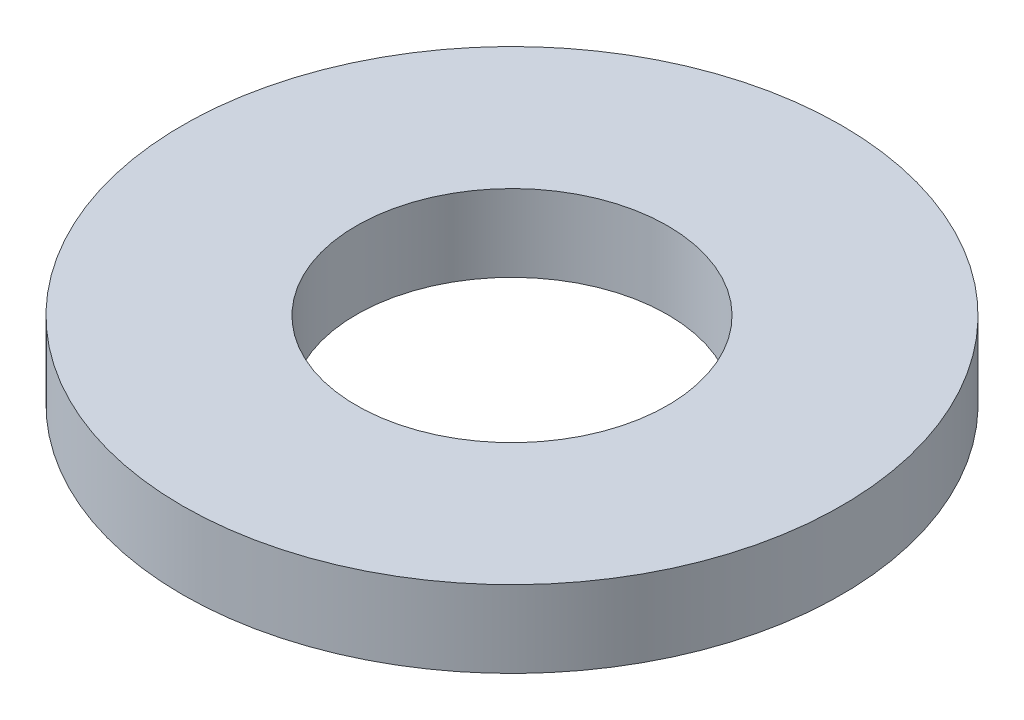
ISO-10303-21;
HEADER;
FILE_DESCRIPTION(('STEP AP214'),'2;1');
FILE_NAME('part.step','',(''),(''),'','','');
FILE_SCHEMA(('AUTOMOTIVE_DESIGN { 1 0 10303 214 1 1 1 1 }'));
ENDSEC;
DATA;
#1=APPLICATION_CONTEXT('core data for automotive mechanical design processes');
#2=APPLICATION_PROTOCOL_DEFINITION('international standard','automotive_design',2000,#1);
#3=PRODUCT_CONTEXT('',#1,'mechanical');
#4=PRODUCT('Part','Part','',(#3));
#5=PRODUCT_RELATED_PRODUCT_CATEGORY('part','',(#4));
#6=PRODUCT_DEFINITION_FORMATION('','',#4);
#7=PRODUCT_DEFINITION_CONTEXT('part definition',#1,'design');
#8=PRODUCT_DEFINITION('design','',#6,#7);
#9=PRODUCT_DEFINITION_SHAPE('','',#8);
#10=(LENGTH_UNIT() NAMED_UNIT(*) SI_UNIT(.MILLI.,.METRE.));
#11=(NAMED_UNIT(*) PLANE_ANGLE_UNIT() SI_UNIT($,.RADIAN.));
#12=(NAMED_UNIT(*) SI_UNIT($,.STERADIAN.) SOLID_ANGLE_UNIT());
#13=UNCERTAINTY_MEASURE_WITH_UNIT(LENGTH_MEASURE(1.E-05),#10,'distance_accuracy_value','');
#14=(GEOMETRIC_REPRESENTATION_CONTEXT(3) GLOBAL_UNCERTAINTY_ASSIGNED_CONTEXT((#13)) GLOBAL_UNIT_ASSIGNED_CONTEXT((#10,
#11,#12)) REPRESENTATION_CONTEXT('',''));
#15=CARTESIAN_POINT('',(0.,0.,0.));
#16=DIRECTION('',(0.,0.,1.));
#17=DIRECTION('',(1.,0.,0.));
#18=AXIS2_PLACEMENT_3D('',#15,#16,#17);
#19=CARTESIAN_POINT('',(0.,21.,0.));
#20=DIRECTION('',(0.,-1.,0.));
#21=DIRECTION('',(0.,0.,-1.));
#22=AXIS2_PLACEMENT_3D('',#19,#20,#21);
#23=CYLINDRICAL_SURFACE('',#22,90.);
#24=CARTESIAN_POINT('',(0.,21.,0.));
#25=DIRECTION('',(0.,1.,0.));
#26=DIRECTION('',(0.,0.,1.));
#27=AXIS2_PLACEMENT_3D('',#24,#25,#26);
#28=CIRCLE('',#27,90.);
#29=CARTESIAN_POINT('',(0.,21.,-90.));
#30=VERTEX_POINT('',#29);
#31=EDGE_CURVE('E10',#30,#30,#28,.T.);
#32=CARTESIAN_POINT('',(0.,0.,0.));
#33=DIRECTION('',(0.,1.,0.));
#34=DIRECTION('',(0.,0.,1.));
#35=AXIS2_PLACEMENT_3D('',#32,#33,#34);
#36=CIRCLE('',#35,90.);
#37=CARTESIAN_POINT('',(0.,0.,-90.));
#38=VERTEX_POINT('',#37);
#39=EDGE_CURVE('E37',#38,#38,#36,.T.);
#40=CARTESIAN_POINT('',(0.,21.,-90.));
#41=CARTESIAN_POINT('',(0.,20.78125,-90.));
#42=CARTESIAN_POINT('',(0.,20.5625,-90.));
#43=CARTESIAN_POINT('',(0.,20.125,-90.));
#44=CARTESIAN_POINT('',(0.,19.90625,-90.));
#45=CARTESIAN_POINT('',(0.,19.46875,-90.));
#46=CARTESIAN_POINT('',(0.,19.25,-90.));
#47=CARTESIAN_POINT('',(0.,18.8125,-90.));
#48=CARTESIAN_POINT('',(0.,18.59375,-90.));
#49=CARTESIAN_POINT('',(0.,18.15625,-90.));
#50=CARTESIAN_POINT('',(0.,17.9375,-90.));
#51=CARTESIAN_POINT('',(0.,17.5,-90.));
#52=CARTESIAN_POINT('',(0.,17.28125,-90.));
#53=CARTESIAN_POINT('',(0.,16.84375,-90.));
#54=CARTESIAN_POINT('',(0.,16.625,-90.));
#55=CARTESIAN_POINT('',(0.,16.1875,-90.));
#56=CARTESIAN_POINT('',(0.,15.96875,-90.));
#57=CARTESIAN_POINT('',(0.,15.53125,-90.));
#58=CARTESIAN_POINT('',(0.,15.3125,-90.));
#59=CARTESIAN_POINT('',(0.,14.875,-90.));
#60=CARTESIAN_POINT('',(0.,14.65625,-90.));
#61=CARTESIAN_POINT('',(0.,14.21875,-90.));
#62=CARTESIAN_POINT('',(0.,14.,-90.));
#63=CARTESIAN_POINT('',(0.,13.5625,-90.));
#64=CARTESIAN_POINT('',(0.,13.34375,-90.));
#65=CARTESIAN_POINT('',(0.,12.90625,-90.));
#66=CARTESIAN_POINT('',(0.,12.6875,-90.));
#67=CARTESIAN_POINT('',(0.,12.25,-90.));
#68=CARTESIAN_POINT('',(0.,12.03125,-90.));
#69=CARTESIAN_POINT('',(0.,11.59375,-90.));
#70=CARTESIAN_POINT('',(0.,11.375,-90.));
#71=CARTESIAN_POINT('',(0.,10.9375,-90.));
#72=CARTESIAN_POINT('',(0.,10.71875,-90.));
#73=CARTESIAN_POINT('',(0.,10.28125,-90.));
#74=CARTESIAN_POINT('',(0.,10.0625,-90.));
#75=CARTESIAN_POINT('',(0.,9.625,-90.));
#76=CARTESIAN_POINT('',(0.,9.40625,-90.));
#77=CARTESIAN_POINT('',(0.,8.96875,-90.));
#78=CARTESIAN_POINT('',(0.,8.75,-90.));
#79=CARTESIAN_POINT('',(0.,8.3125,-90.));
#80=CARTESIAN_POINT('',(0.,8.09375,-90.));
#81=CARTESIAN_POINT('',(0.,7.65625,-90.));
#82=CARTESIAN_POINT('',(0.,7.4375,-90.));
#83=CARTESIAN_POINT('',(0.,7.,-90.));
#84=CARTESIAN_POINT('',(0.,6.78125,-90.));
#85=CARTESIAN_POINT('',(0.,6.34375,-90.));
#86=CARTESIAN_POINT('',(0.,6.125,-90.));
#87=CARTESIAN_POINT('',(0.,5.6875,-90.));
#88=CARTESIAN_POINT('',(0.,5.46875,-90.));
#89=CARTESIAN_POINT('',(0.,5.03125,-90.));
#90=CARTESIAN_POINT('',(0.,4.8125,-90.));
#91=CARTESIAN_POINT('',(0.,4.375,-90.));
#92=CARTESIAN_POINT('',(0.,4.15625,-90.));
#93=CARTESIAN_POINT('',(0.,3.71875,-90.));
#94=CARTESIAN_POINT('',(0.,3.5,-90.));
#95=CARTESIAN_POINT('',(0.,3.0625,-90.));
#96=CARTESIAN_POINT('',(0.,2.84375,-90.));
#97=CARTESIAN_POINT('',(0.,2.40625,-90.));
#98=CARTESIAN_POINT('',(0.,2.1875,-90.));
#99=CARTESIAN_POINT('',(0.,1.75,-90.));
#100=CARTESIAN_POINT('',(0.,1.53125,-90.));
#101=CARTESIAN_POINT('',(0.,1.09375,-90.));
#102=CARTESIAN_POINT('',(0.,0.875000000000001,-90.));
#103=CARTESIAN_POINT('',(0.,0.4375,-90.));
#104=CARTESIAN_POINT('',(0.,0.21875,-90.));
#105=CARTESIAN_POINT('',(0.,0.,-90.));
#106=B_SPLINE_CURVE_WITH_KNOTS('',3,(#40,#41,#42,#43,#44,#45,#46,#47,#48,#49,#50,#51,#52,#53,
#54,#55,#56,#57,#58,#59,#60,#61,#62,#63,#64,#65,#66,#67,#68,#69,#70,#71,#72,#73,#74,#75,#76,#77,
#78,#79,#80,#81,#82,#83,#84,#85,#86,#87,#88,#89,#90,#91,#92,#93,#94,#95,#96,#97,#98,#99,#100,
#101,#102,#103,#104,#105),.UNSPECIFIED.,.F.,.F.,(4,2,2,2,2,2,2,2,2,2,2,2,2,2,2,2,2,2,2,2,2,2,2,
2,2,2,2,2,2,2,2,2,4),(0.,0.656250000000001,1.3125,1.96875,2.625,3.28125,3.9375,4.59375,5.25,
5.90625,6.5625,7.21875,7.875,8.53125,9.1875,9.84375,10.5,11.15625,11.8125,12.46875,13.125,
13.78125,14.4375,15.09375,15.75,16.40625,17.0625,17.71875,18.375,19.03125,19.6875,20.34375,21.),.UNSPECIFIED.);
#107=EDGE_CURVE('BSEAM40',#30,#38,#106,.T.);
#108=ORIENTED_EDGE('',*,*,#31,.F.);
#109=ORIENTED_EDGE('',*,*,#39,.T.);
#110=ORIENTED_EDGE('',*,*,#107,.T.);
#111=ORIENTED_EDGE('',*,*,#107,.F.);
#112=EDGE_LOOP('',(#108,#110,#109,#111));
#113=FACE_BOUND('',#112,.T.);
#114=ADVANCED_FACE('F40',(#113),#23,.T.);
#115=CARTESIAN_POINT('',(0.,21.,0.));
#116=DIRECTION('',(0.,1.,0.));
#117=DIRECTION('',(0.,0.,1.));
#118=AXIS2_PLACEMENT_3D('',#115,#116,#117);
#119=PLANE('',#118);
#120=CARTESIAN_POINT('',(0.,21.,0.));
#121=DIRECTION('',(0.,1.,0.));
#122=DIRECTION('',(0.,0.,1.));
#123=AXIS2_PLACEMENT_3D('',#120,#121,#122);
#124=CIRCLE('',#123,42.5);
#125=CARTESIAN_POINT('',(0.,21.,-42.5));
#126=VERTEX_POINT('',#125);
#127=EDGE_CURVE('E50',#126,#126,#124,.T.);
#128=ORIENTED_EDGE('',*,*,#127,.F.);
#129=EDGE_LOOP('',(#128));
#130=FACE_BOUND('',#129,.T.);
#131=ORIENTED_EDGE('',*,*,#31,.T.);
#132=EDGE_LOOP('',(#131));
#133=FACE_BOUND('',#132,.T.);
#134=ADVANCED_FACE('F59',(#130,#133),#119,.T.);
#135=CARTESIAN_POINT('',(0.,0.,0.));
#136=DIRECTION('',(0.,1.,0.));
#137=DIRECTION('',(0.,0.,1.));
#138=AXIS2_PLACEMENT_3D('',#135,#136,#137);
#139=PLANE('',#138);
#140=CARTESIAN_POINT('',(0.,0.,0.));
#141=DIRECTION('',(0.,1.,0.));
#142=DIRECTION('',(0.,0.,1.));
#143=AXIS2_PLACEMENT_3D('',#140,#141,#142);
#144=CIRCLE('',#143,42.5);
#145=CARTESIAN_POINT('',(0.,0.,-42.5));
#146=VERTEX_POINT('',#145);
#147=EDGE_CURVE('E47',#146,#146,#144,.T.);
#148=ORIENTED_EDGE('',*,*,#147,.T.);
#149=EDGE_LOOP('',(#148));
#150=FACE_BOUND('',#149,.T.);
#151=ORIENTED_EDGE('',*,*,#39,.F.);
#152=EDGE_LOOP('',(#151));
#153=FACE_BOUND('',#152,.T.);
#154=ADVANCED_FACE('F58',(#150,#153),#139,.F.);
#155=CARTESIAN_POINT('',(0.,21.,0.));
#156=DIRECTION('',(0.,-1.,0.));
#157=DIRECTION('',(0.,0.,-1.));
#158=AXIS2_PLACEMENT_3D('',#155,#156,#157);
#159=CYLINDRICAL_SURFACE('',#158,42.5);
#160=CARTESIAN_POINT('',(0.,21.,-42.5));
#161=CARTESIAN_POINT('',(0.,20.78125,-42.5));
#162=CARTESIAN_POINT('',(0.,20.5625,-42.5));
#163=CARTESIAN_POINT('',(0.,20.125,-42.5));
#164=CARTESIAN_POINT('',(0.,19.90625,-42.5));
#165=CARTESIAN_POINT('',(0.,19.46875,-42.5));
#166=CARTESIAN_POINT('',(0.,19.25,-42.5));
#167=CARTESIAN_POINT('',(0.,18.8125,-42.5));
#168=CARTESIAN_POINT('',(0.,18.59375,-42.5));
#169=CARTESIAN_POINT('',(0.,18.15625,-42.5));
#170=CARTESIAN_POINT('',(0.,17.9375,-42.5));
#171=CARTESIAN_POINT('',(0.,17.5,-42.5));
#172=CARTESIAN_POINT('',(0.,17.28125,-42.5));
#173=CARTESIAN_POINT('',(0.,16.84375,-42.5));
#174=CARTESIAN_POINT('',(0.,16.625,-42.5));
#175=CARTESIAN_POINT('',(0.,16.1875,-42.5));
#176=CARTESIAN_POINT('',(0.,15.96875,-42.5));
#177=CARTESIAN_POINT('',(0.,15.53125,-42.5));
#178=CARTESIAN_POINT('',(0.,15.3125,-42.5));
#179=CARTESIAN_POINT('',(0.,14.875,-42.5));
#180=CARTESIAN_POINT('',(0.,14.65625,-42.5));
#181=CARTESIAN_POINT('',(0.,14.21875,-42.5));
#182=CARTESIAN_POINT('',(0.,14.,-42.5));
#183=CARTESIAN_POINT('',(0.,13.5625,-42.5));
#184=CARTESIAN_POINT('',(0.,13.34375,-42.5));
#185=CARTESIAN_POINT('',(0.,12.90625,-42.5));
#186=CARTESIAN_POINT('',(0.,12.6875,-42.5));
#187=CARTESIAN_POINT('',(0.,12.25,-42.5));
#188=CARTESIAN_POINT('',(0.,12.03125,-42.5));
#189=CARTESIAN_POINT('',(0.,11.59375,-42.5));
#190=CARTESIAN_POINT('',(0.,11.375,-42.5));
#191=CARTESIAN_POINT('',(0.,10.9375,-42.5));
#192=CARTESIAN_POINT('',(0.,10.71875,-42.5));
#193=CARTESIAN_POINT('',(0.,10.28125,-42.5));
#194=CARTESIAN_POINT('',(0.,10.0625,-42.5));
#195=CARTESIAN_POINT('',(0.,9.625,-42.5));
#196=CARTESIAN_POINT('',(0.,9.40625,-42.5));
#197=CARTESIAN_POINT('',(0.,8.96875,-42.5));
#198=CARTESIAN_POINT('',(0.,8.75,-42.5));
#199=CARTESIAN_POINT('',(0.,8.3125,-42.5));
#200=CARTESIAN_POINT('',(0.,8.09375,-42.5));
#201=CARTESIAN_POINT('',(0.,7.65625,-42.5));
#202=CARTESIAN_POINT('',(0.,7.4375,-42.5));
#203=CARTESIAN_POINT('',(0.,7.,-42.5));
#204=CARTESIAN_POINT('',(0.,6.78125,-42.5));
#205=CARTESIAN_POINT('',(0.,6.34375,-42.5));
#206=CARTESIAN_POINT('',(0.,6.125,-42.5));
#207=CARTESIAN_POINT('',(0.,5.6875,-42.5));
#208=CARTESIAN_POINT('',(0.,5.46875,-42.5));
#209=CARTESIAN_POINT('',(0.,5.03125,-42.5));
#210=CARTESIAN_POINT('',(0.,4.8125,-42.5));
#211=CARTESIAN_POINT('',(0.,4.375,-42.5));
#212=CARTESIAN_POINT('',(0.,4.15625,-42.5));
#213=CARTESIAN_POINT('',(0.,3.71875,-42.5));
#214=CARTESIAN_POINT('',(0.,3.5,-42.5));
#215=CARTESIAN_POINT('',(0.,3.0625,-42.5));
#216=CARTESIAN_POINT('',(0.,2.84375,-42.5));
#217=CARTESIAN_POINT('',(0.,2.40625,-42.5));
#218=CARTESIAN_POINT('',(0.,2.1875,-42.5));
#219=CARTESIAN_POINT('',(0.,1.75,-42.5));
#220=CARTESIAN_POINT('',(0.,1.53125,-42.5));
#221=CARTESIAN_POINT('',(0.,1.09375,-42.5));
#222=CARTESIAN_POINT('',(0.,0.875000000000001,-42.5));
#223=CARTESIAN_POINT('',(0.,0.4375,-42.5));
#224=CARTESIAN_POINT('',(0.,0.21875,-42.5));
#225=CARTESIAN_POINT('',(0.,0.,-42.5));
#226=B_SPLINE_CURVE_WITH_KNOTS('',3,(#160,#161,#162,#163,#164,#165,#166,#167,#168,#169,#170,
#171,#172,#173,#174,#175,#176,#177,#178,#179,#180,#181,#182,#183,#184,#185,#186,#187,#188,#189,
#190,#191,#192,#193,#194,#195,#196,#197,#198,#199,#200,#201,#202,#203,#204,#205,#206,#207,#208,
#209,#210,#211,#212,#213,#214,#215,#216,#217,#218,#219,#220,#221,#222,#223,#224,#225),
.UNSPECIFIED.,.F.,.F.,(4,2,2,2,2,2,2,2,2,2,2,2,2,2,2,2,2,2,2,2,2,2,2,2,2,2,2,2,2,2,2,2,4),(0.,
0.656249999999997,1.3125,1.96875,2.625,3.28125,3.9375,4.59375,5.25,5.90625,6.5625,7.21875,7.875,
8.53125,9.1875,9.84375,10.5,11.15625,11.8125,12.46875,13.125,13.78125,14.4375,15.09375,15.75,
16.40625,17.0625,17.71875,18.375,19.03125,19.6875,20.34375,21.),.UNSPECIFIED.);
#227=EDGE_CURVE('BSEAM54',#126,#146,#226,.T.);
#228=ORIENTED_EDGE('',*,*,#127,.T.);
#229=ORIENTED_EDGE('',*,*,#147,.F.);
#230=ORIENTED_EDGE('',*,*,#227,.T.);
#231=ORIENTED_EDGE('',*,*,#227,.F.);
#232=EDGE_LOOP('',(#228,#230,#229,#231));
#233=FACE_BOUND('',#232,.T.);
#234=ADVANCED_FACE('F54',(#233),#159,.F.);
#235=CLOSED_SHELL('',(#114,#134,#154,#234));
#236=MANIFOLD_SOLID_BREP('B2',#235);
#237=ADVANCED_BREP_SHAPE_REPRESENTATION('',(#18,#236),#14);
#238=SHAPE_DEFINITION_REPRESENTATION(#9,#237);
ENDSEC;
END-ISO-10303-21;
